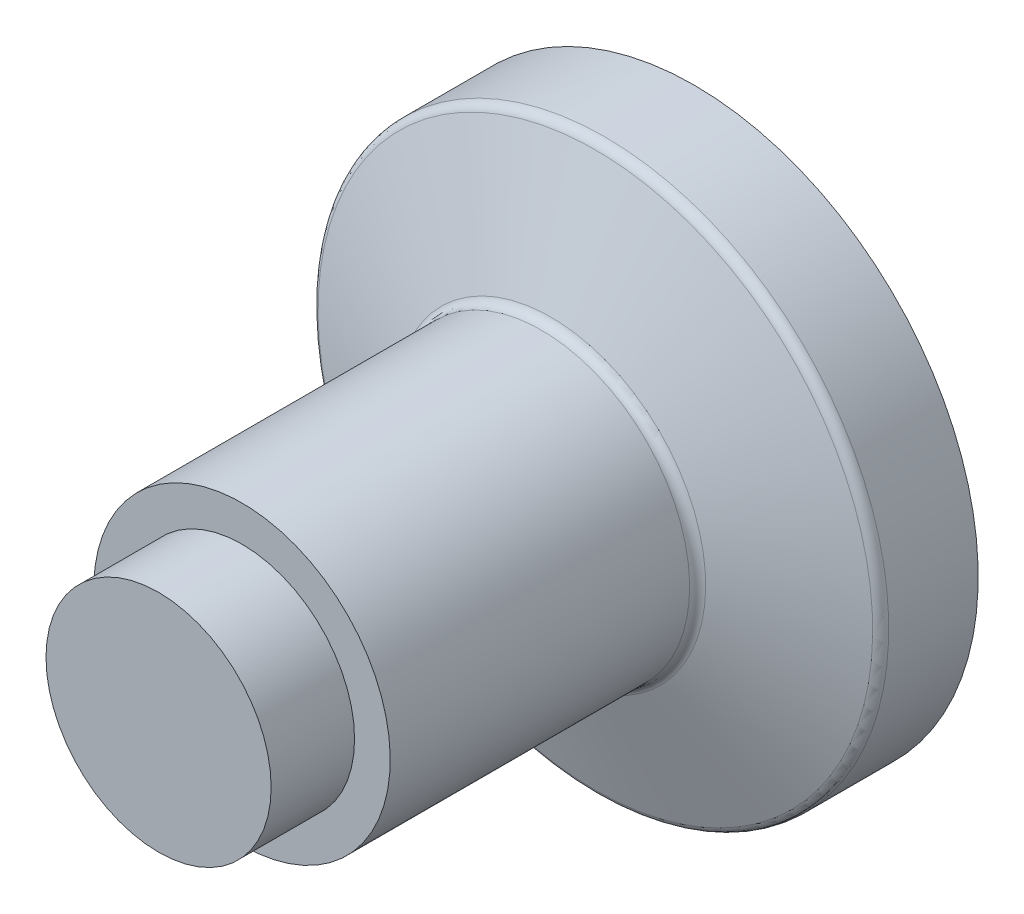
ISO-10303-21;
HEADER;
FILE_DESCRIPTION(('STEP AP214'),'2;1');
FILE_NAME('part.step','',(''),(''),'','','');
FILE_SCHEMA(('AUTOMOTIVE_DESIGN { 1 0 10303 214 1 1 1 1 }'));
ENDSEC;
DATA;
#1=APPLICATION_CONTEXT('core data for automotive mechanical design processes');
#2=APPLICATION_PROTOCOL_DEFINITION('international standard','automotive_design',2000,#1);
#3=PRODUCT_CONTEXT('',#1,'mechanical');
#4=PRODUCT('Part','Part','',(#3));
#5=PRODUCT_RELATED_PRODUCT_CATEGORY('part','',(#4));
#6=PRODUCT_DEFINITION_FORMATION('','',#4);
#7=PRODUCT_DEFINITION_CONTEXT('part definition',#1,'design');
#8=PRODUCT_DEFINITION('design','',#6,#7);
#9=PRODUCT_DEFINITION_SHAPE('','',#8);
#10=(LENGTH_UNIT() NAMED_UNIT(*) SI_UNIT(.MILLI.,.METRE.));
#11=(NAMED_UNIT(*) PLANE_ANGLE_UNIT() SI_UNIT($,.RADIAN.));
#12=(NAMED_UNIT(*) SI_UNIT($,.STERADIAN.) SOLID_ANGLE_UNIT());
#13=UNCERTAINTY_MEASURE_WITH_UNIT(LENGTH_MEASURE(1.E-05),#10,'distance_accuracy_value','');
#14=(GEOMETRIC_REPRESENTATION_CONTEXT(3) GLOBAL_UNCERTAINTY_ASSIGNED_CONTEXT((#13)) GLOBAL_UNIT_ASSIGNED_CONTEXT((#10,
#11,#12)) REPRESENTATION_CONTEXT('',''));
#15=CARTESIAN_POINT('',(0.,0.,0.));
#16=DIRECTION('',(0.,0.,1.));
#17=DIRECTION('',(1.,0.,0.));
#18=AXIS2_PLACEMENT_3D('',#15,#16,#17);
#19=CARTESIAN_POINT('',(0.,0.,-39.0258869199825));
#20=DIRECTION('',(0.,0.,-1.));
#21=DIRECTION('',(0.,1.,0.));
#22=AXIS2_PLACEMENT_3D('',#19,#20,#21);
#23=CONICAL_SURFACE('',#22,15.4079798566743,1.22173047639604);
#24=CARTESIAN_POINT('',(0.,0.,-43.4605149174238));
#25=DIRECTION('',(0.,0.,1.));
#26=DIRECTION('',(0.,-1.,0.));
#27=AXIS2_PLACEMENT_3D('',#24,#25,#26);
#28=CIRCLE('',#27,27.5920201433257);
#29=CARTESIAN_POINT('',(0.,-27.5920201433257,-43.4605149174238));
#30=VERTEX_POINT('',#29);
#31=EDGE_CURVE('E78',#30,#30,#28,.T.);
#32=ORIENTED_EDGE('',*,*,#31,.T.);
#33=EDGE_LOOP('',(#32));
#34=FACE_BOUND('',#33,.T.);
#35=CARTESIAN_POINT('',(0.,0.,-39.0258869199825));
#36=DIRECTION('',(0.,0.,1.));
#37=DIRECTION('',(0.,-1.,0.));
#38=AXIS2_PLACEMENT_3D('',#35,#36,#37);
#39=CIRCLE('',#38,15.4079798566743);
#40=CARTESIAN_POINT('',(0.,-15.4079798566743,-39.0258869199825));
#41=VERTEX_POINT('',#40);
#42=EDGE_CURVE('E10',#41,#41,#39,.T.);
#43=ORIENTED_EDGE('',*,*,#42,.F.);
#44=EDGE_LOOP('',(#43));
#45=FACE_BOUND('',#44,.T.);
#46=ADVANCED_FACE('F39',(#34,#45),#23,.T.);
#47=CARTESIAN_POINT('',(0.,0.,-38.0861942991966));
#48=DIRECTION('',(0.,0.,1.));
#49=DIRECTION('',(0.,-1.,0.));
#50=AXIS2_PLACEMENT_3D('',#47,#48,#49);
#51=TOROIDAL_SURFACE('',#50,15.75,1.);
#52=CARTESIAN_POINT('',(0.,0.,-38.0861942991966));
#53=DIRECTION('',(0.,0.,1.));
#54=DIRECTION('',(0.,-1.,0.));
#55=AXIS2_PLACEMENT_3D('',#52,#53,#54);
#56=CIRCLE('',#55,14.75);
#57=CARTESIAN_POINT('',(0.,-14.75,-38.0861942991966));
#58=VERTEX_POINT('',#57);
#59=EDGE_CURVE('E46',#58,#58,#56,.T.);
#60=ORIENTED_EDGE('',*,*,#59,.F.);
#61=EDGE_LOOP('',(#60));
#62=FACE_BOUND('',#61,.T.);
#63=ORIENTED_EDGE('',*,*,#42,.T.);
#64=EDGE_LOOP('',(#63));
#65=FACE_BOUND('',#64,.T.);
#66=ADVANCED_FACE('F103',(#62,#65),#51,.F.);
#67=CARTESIAN_POINT('',(0.,0.,0.));
#68=DIRECTION('',(0.,0.,1.));
#69=DIRECTION('',(0.,-1.,0.));
#70=AXIS2_PLACEMENT_3D('',#67,#68,#69);
#71=CYLINDRICAL_SURFACE('',#70,14.75);
#72=ORIENTED_EDGE('',*,*,#59,.T.);
#73=EDGE_LOOP('',(#72));
#74=FACE_BOUND('',#73,.T.);
#75=CARTESIAN_POINT('',(0.,0.,-8.3));
#76=DIRECTION('',(0.,0.,1.));
#77=DIRECTION('',(0.,-1.,0.));
#78=AXIS2_PLACEMENT_3D('',#75,#76,#77);
#79=CIRCLE('',#78,14.75);
#80=CARTESIAN_POINT('',(0.,-14.75,-8.3));
#81=VERTEX_POINT('',#80);
#82=EDGE_CURVE('E51',#81,#81,#79,.T.);
#83=ORIENTED_EDGE('',*,*,#82,.F.);
#84=EDGE_LOOP('',(#83));
#85=FACE_BOUND('',#84,.T.);
#86=ADVANCED_FACE('F107',(#74,#85),#71,.T.);
#87=CARTESIAN_POINT('',(0.,0.,-8.3));
#88=DIRECTION('',(0.,0.,-1.));
#89=DIRECTION('',(0.,1.,0.));
#90=AXIS2_PLACEMENT_3D('',#87,#88,#89);
#91=PLANE('',#90);
#92=CARTESIAN_POINT('',(0.,0.,-8.3));
#93=DIRECTION('',(0.,0.,1.));
#94=DIRECTION('',(0.,-1.,0.));
#95=AXIS2_PLACEMENT_3D('',#92,#93,#94);
#96=CIRCLE('',#95,11.2);
#97=CARTESIAN_POINT('',(0.,-11.2,-8.3));
#98=VERTEX_POINT('',#97);
#99=EDGE_CURVE('E56',#98,#98,#96,.T.);
#100=ORIENTED_EDGE('',*,*,#99,.F.);
#101=EDGE_LOOP('',(#100));
#102=FACE_BOUND('',#101,.T.);
#103=ORIENTED_EDGE('',*,*,#82,.T.);
#104=EDGE_LOOP('',(#103));
#105=FACE_BOUND('',#104,.T.);
#106=ADVANCED_FACE('F112',(#102,#105),#91,.F.);
#107=CARTESIAN_POINT('',(0.,0.,0.));
#108=DIRECTION('',(0.,0.,1.));
#109=DIRECTION('',(0.,-1.,0.));
#110=AXIS2_PLACEMENT_3D('',#107,#108,#109);
#111=CYLINDRICAL_SURFACE('',#110,11.2);
#112=CARTESIAN_POINT('',(0.,0.,0.));
#113=DIRECTION('',(0.,0.,1.));
#114=DIRECTION('',(0.,-1.,0.));
#115=AXIS2_PLACEMENT_3D('',#112,#113,#114);
#116=CIRCLE('',#115,11.2);
#117=CARTESIAN_POINT('',(0.,-11.2,0.));
#118=VERTEX_POINT('',#117);
#119=EDGE_CURVE('E62',#118,#118,#116,.T.);
#120=ORIENTED_EDGE('',*,*,#119,.F.);
#121=EDGE_LOOP('',(#120));
#122=FACE_BOUND('',#121,.T.);
#123=ORIENTED_EDGE('',*,*,#99,.T.);
#124=EDGE_LOOP('',(#123));
#125=FACE_BOUND('',#124,.T.);
#126=ADVANCED_FACE('F117',(#122,#125),#111,.T.);
#127=CARTESIAN_POINT('',(0.,0.,0.));
#128=DIRECTION('',(0.,0.,1.));
#129=DIRECTION('',(0.,-1.,0.));
#130=AXIS2_PLACEMENT_3D('',#127,#128,#129);
#131=PLANE('',#130);
#132=ORIENTED_EDGE('',*,*,#119,.T.);
#133=EDGE_LOOP('',(#132));
#134=FACE_BOUND('',#133,.T.);
#135=ADVANCED_FACE('F121',(#134),#131,.T.);
#136=CARTESIAN_POINT('',(0.,0.,-16.0623263888889));
#137=DIRECTION('',(0.,0.,1.));
#138=DIRECTION('',(0.,1.,0.));
#139=AXIS2_PLACEMENT_3D('',#136,#137,#138);
#140=SPHERICAL_SURFACE('',#139,44.4376736111111);
#141=CARTESIAN_POINT('',(0.,0.,-53.3));
#142=DIRECTION('',(0.,0.,1.));
#143=DIRECTION('',(0.,-1.,0.));
#144=AXIS2_PLACEMENT_3D('',#141,#142,#143);
#145=CIRCLE('',#144,24.25);
#146=CARTESIAN_POINT('',(0.,-24.25,-53.3));
#147=VERTEX_POINT('',#146);
#148=EDGE_CURVE('E66',#147,#147,#145,.T.);
#149=ORIENTED_EDGE('',*,*,#148,.F.);
#150=EDGE_LOOP('',(#149));
#151=FACE_BOUND('',#150,.T.);
#152=ADVANCED_FACE('F99',(#151),#140,.T.);
#153=CARTESIAN_POINT('',(0.,0.,-53.3));
#154=DIRECTION('',(0.,0.,-1.));
#155=DIRECTION('',(0.,1.,0.));
#156=AXIS2_PLACEMENT_3D('',#153,#154,#155);
#157=PLANE('',#156);
#158=ORIENTED_EDGE('',*,*,#148,.T.);
#159=EDGE_LOOP('',(#158));
#160=FACE_BOUND('',#159,.T.);
#161=CARTESIAN_POINT('',(0.,0.,-53.3));
#162=DIRECTION('',(0.,0.,1.));
#163=DIRECTION('',(0.,-1.,0.));
#164=AXIS2_PLACEMENT_3D('',#161,#162,#163);
#165=CIRCLE('',#164,28.25);
#166=CARTESIAN_POINT('',(0.,-28.25,-53.3));
#167=VERTEX_POINT('',#166);
#168=EDGE_CURVE('E70',#167,#167,#165,.T.);
#169=ORIENTED_EDGE('',*,*,#168,.F.);
#170=EDGE_LOOP('',(#169));
#171=FACE_BOUND('',#170,.T.);
#172=ADVANCED_FACE('F93',(#160,#171),#157,.T.);
#173=CARTESIAN_POINT('',(0.,0.,0.));
#174=DIRECTION('',(0.,0.,1.));
#175=DIRECTION('',(0.,-1.,0.));
#176=AXIS2_PLACEMENT_3D('',#173,#174,#175);
#177=CYLINDRICAL_SURFACE('',#176,28.25);
#178=ORIENTED_EDGE('',*,*,#168,.T.);
#179=EDGE_LOOP('',(#178));
#180=FACE_BOUND('',#179,.T.);
#181=CARTESIAN_POINT('',(0.,0.,-44.4002075382097));
#182=DIRECTION('',(0.,0.,1.));
#183=DIRECTION('',(0.,-1.,0.));
#184=AXIS2_PLACEMENT_3D('',#181,#182,#183);
#185=CIRCLE('',#184,28.25);
#186=CARTESIAN_POINT('',(0.,-28.25,-44.4002075382097));
#187=VERTEX_POINT('',#186);
#188=EDGE_CURVE('E74',#187,#187,#185,.T.);
#189=ORIENTED_EDGE('',*,*,#188,.F.);
#190=EDGE_LOOP('',(#189));
#191=FACE_BOUND('',#190,.T.);
#192=ADVANCED_FACE('F88',(#180,#191),#177,.T.);
#193=CARTESIAN_POINT('',(0.,0.,-44.4002075382097));
#194=DIRECTION('',(0.,0.,1.));
#195=DIRECTION('',(0.,-1.,0.));
#196=AXIS2_PLACEMENT_3D('',#193,#194,#195);
#197=TOROIDAL_SURFACE('',#196,27.25,1.);
#198=ORIENTED_EDGE('',*,*,#31,.F.);
#199=EDGE_LOOP('',(#198));
#200=FACE_BOUND('',#199,.T.);
#201=ORIENTED_EDGE('',*,*,#188,.T.);
#202=EDGE_LOOP('',(#201));
#203=FACE_BOUND('',#202,.T.);
#204=ADVANCED_FACE('F85',(#200,#203),#197,.T.);
#205=CLOSED_SHELL('',(#46,#66,#86,#106,#126,#135,#152,#172,#192,#204));
#206=MANIFOLD_SOLID_BREP('B2',#205);
#207=ADVANCED_BREP_SHAPE_REPRESENTATION('',(#18,#206),#14);
#208=SHAPE_DEFINITION_REPRESENTATION(#9,#207);
ENDSEC;
END-ISO-10303-21;
